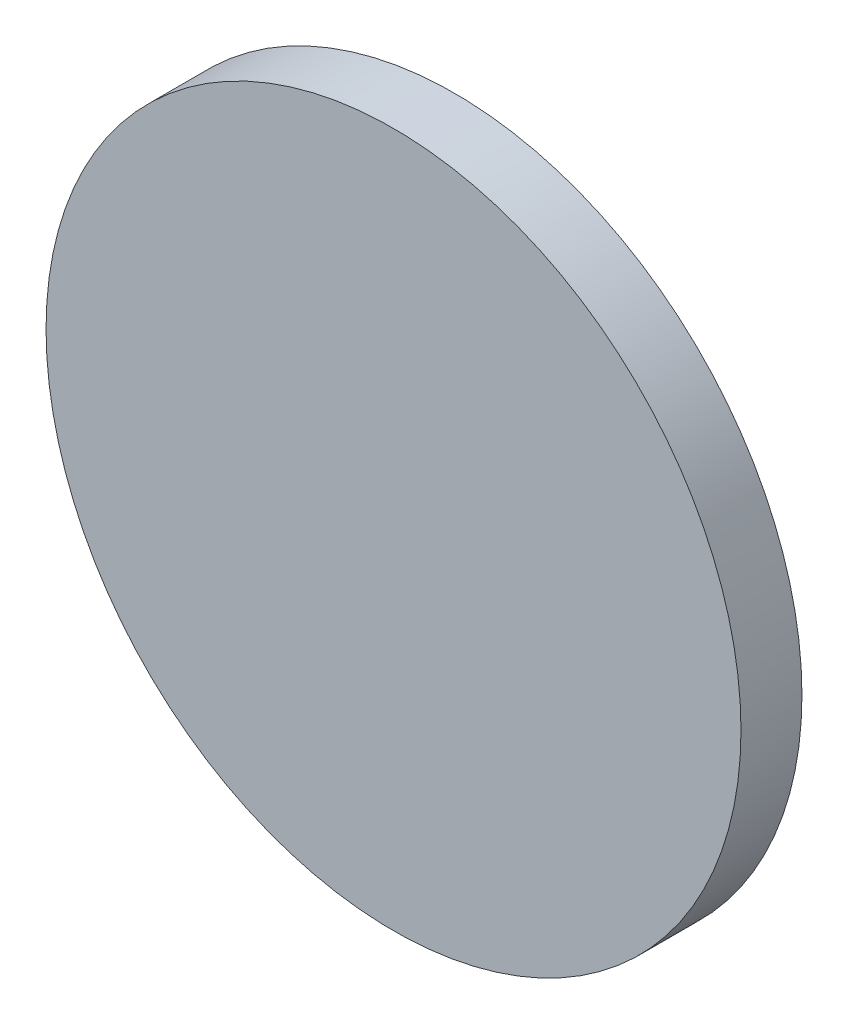
ISO-10303-21;
HEADER;
FILE_DESCRIPTION(('STEP AP214'),'2;1');
FILE_NAME('part.step','',(''),(''),'','','');
FILE_SCHEMA(('AUTOMOTIVE_DESIGN { 1 0 10303 214 1 1 1 1 }'));
ENDSEC;
DATA;
#1=APPLICATION_CONTEXT('core data for automotive mechanical design processes');
#2=APPLICATION_PROTOCOL_DEFINITION('international standard','automotive_design',2000,#1);
#3=PRODUCT_CONTEXT('',#1,'mechanical');
#4=PRODUCT('Part','Part','',(#3));
#5=PRODUCT_RELATED_PRODUCT_CATEGORY('part','',(#4));
#6=PRODUCT_DEFINITION_FORMATION('','',#4);
#7=PRODUCT_DEFINITION_CONTEXT('part definition',#1,'design');
#8=PRODUCT_DEFINITION('design','',#6,#7);
#9=PRODUCT_DEFINITION_SHAPE('','',#8);
#10=(LENGTH_UNIT() NAMED_UNIT(*) SI_UNIT(.MILLI.,.METRE.));
#11=(NAMED_UNIT(*) PLANE_ANGLE_UNIT() SI_UNIT($,.RADIAN.));
#12=(NAMED_UNIT(*) SI_UNIT($,.STERADIAN.) SOLID_ANGLE_UNIT());
#13=UNCERTAINTY_MEASURE_WITH_UNIT(LENGTH_MEASURE(1.E-05),#10,'distance_accuracy_value','');
#14=(GEOMETRIC_REPRESENTATION_CONTEXT(3) GLOBAL_UNCERTAINTY_ASSIGNED_CONTEXT((#13)) GLOBAL_UNIT_ASSIGNED_CONTEXT((#10,
#11,#12)) REPRESENTATION_CONTEXT('',''));
#15=CARTESIAN_POINT('',(0.,0.,0.));
#16=DIRECTION('',(0.,0.,1.));
#17=DIRECTION('',(1.,0.,0.));
#18=AXIS2_PLACEMENT_3D('',#15,#16,#17);
#19=CARTESIAN_POINT('',(0.,0.,10.));
#20=DIRECTION('',(0.,0.,-1.));
#21=DIRECTION('',(-1.,0.,0.));
#22=AXIS2_PLACEMENT_3D('',#19,#20,#21);
#23=CYLINDRICAL_SURFACE('',#22,56.9932360110676);
#24=CARTESIAN_POINT('',(0.,0.,10.));
#25=DIRECTION('',(0.,0.,1.));
#26=DIRECTION('',(1.,0.,0.));
#27=AXIS2_PLACEMENT_3D('',#24,#25,#26);
#28=CIRCLE('',#27,56.9932360110676);
#29=CARTESIAN_POINT('',(56.9932360110676,0.,10.));
#30=VERTEX_POINT('',#29);
#31=EDGE_CURVE('E12',#30,#30,#28,.T.);
#32=ORIENTED_EDGE('',*,*,#31,.F.);
#33=EDGE_LOOP('',(#32));
#34=FACE_BOUND('',#33,.T.);
#35=CARTESIAN_POINT('',(0.,0.,0.));
#36=DIRECTION('',(0.,0.,1.));
#37=DIRECTION('',(1.,0.,0.));
#38=AXIS2_PLACEMENT_3D('',#35,#36,#37);
#39=CIRCLE('',#38,56.9932360110676);
#40=CARTESIAN_POINT('',(56.9932360110676,0.,0.));
#41=VERTEX_POINT('',#40);
#42=EDGE_CURVE('E44',#41,#41,#39,.T.);
#43=ORIENTED_EDGE('',*,*,#42,.T.);
#44=EDGE_LOOP('',(#43));
#45=FACE_BOUND('',#44,.T.);
#46=ADVANCED_FACE('F41',(#34,#45),#23,.T.);
#47=CARTESIAN_POINT('',(0.,0.,10.));
#48=DIRECTION('',(0.,0.,1.));
#49=DIRECTION('',(1.,0.,0.));
#50=AXIS2_PLACEMENT_3D('',#47,#48,#49);
#51=PLANE('',#50);
#52=ORIENTED_EDGE('',*,*,#31,.T.);
#53=EDGE_LOOP('',(#52));
#54=FACE_BOUND('',#53,.T.);
#55=ADVANCED_FACE('F56',(#54),#51,.T.);
#56=CARTESIAN_POINT('',(0.,0.,0.));
#57=DIRECTION('',(0.,0.,1.));
#58=DIRECTION('',(1.,0.,0.));
#59=AXIS2_PLACEMENT_3D('',#56,#57,#58);
#60=PLANE('',#59);
#61=ORIENTED_EDGE('',*,*,#42,.F.);
#62=EDGE_LOOP('',(#61));
#63=FACE_BOUND('',#62,.T.);
#64=ADVANCED_FACE('F54',(#63),#60,.F.);
#65=CLOSED_SHELL('',(#46,#55,#64));
#66=MANIFOLD_SOLID_BREP('B2',#65);
#67=ADVANCED_BREP_SHAPE_REPRESENTATION('',(#18,#66),#14);
#68=SHAPE_DEFINITION_REPRESENTATION(#9,#67);
ENDSEC;
END-ISO-10303-21;
